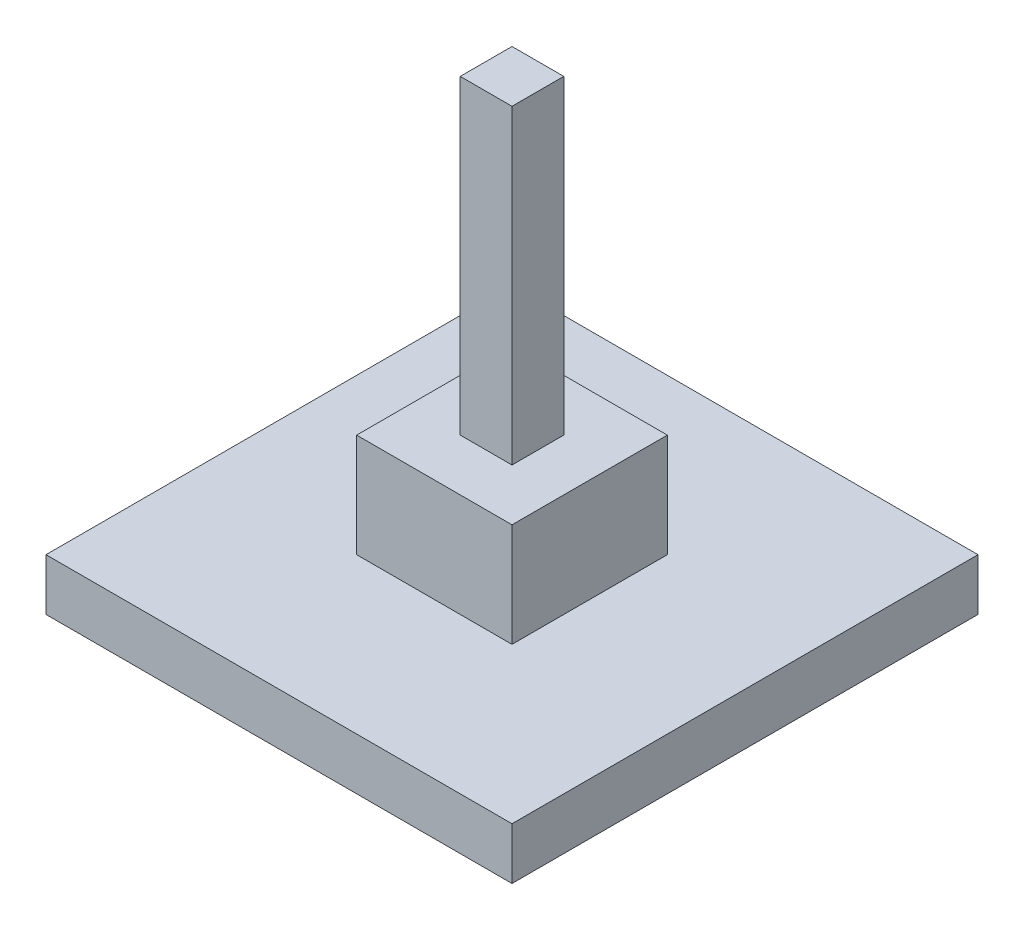
ISO-10303-21;
HEADER;
FILE_DESCRIPTION(('STEP AP214'),'2;1');
FILE_NAME('part.step','',(''),(''),'','','');
FILE_SCHEMA(('AUTOMOTIVE_DESIGN { 1 0 10303 214 1 1 1 1 }'));
ENDSEC;
DATA;
#1=APPLICATION_CONTEXT('core data for automotive mechanical design processes');
#2=APPLICATION_PROTOCOL_DEFINITION('international standard','automotive_design',2000,#1);
#3=PRODUCT_CONTEXT('',#1,'mechanical');
#4=PRODUCT('Part','Part','',(#3));
#5=PRODUCT_RELATED_PRODUCT_CATEGORY('part','',(#4));
#6=PRODUCT_DEFINITION_FORMATION('','',#4);
#7=PRODUCT_DEFINITION_CONTEXT('part definition',#1,'design');
#8=PRODUCT_DEFINITION('design','',#6,#7);
#9=PRODUCT_DEFINITION_SHAPE('','',#8);
#10=(LENGTH_UNIT() NAMED_UNIT(*) SI_UNIT(.MILLI.,.METRE.));
#11=(NAMED_UNIT(*) PLANE_ANGLE_UNIT() SI_UNIT($,.RADIAN.));
#12=(NAMED_UNIT(*) SI_UNIT($,.STERADIAN.) SOLID_ANGLE_UNIT());
#13=UNCERTAINTY_MEASURE_WITH_UNIT(LENGTH_MEASURE(1.E-05),#10,'distance_accuracy_value','');
#14=(GEOMETRIC_REPRESENTATION_CONTEXT(3) GLOBAL_UNCERTAINTY_ASSIGNED_CONTEXT((#13)) GLOBAL_UNIT_ASSIGNED_CONTEXT((#10,
#11,#12)) REPRESENTATION_CONTEXT('',''));
#15=CARTESIAN_POINT('',(0.,0.,0.));
#16=DIRECTION('',(0.,0.,1.));
#17=DIRECTION('',(1.,0.,0.));
#18=AXIS2_PLACEMENT_3D('',#15,#16,#17);
#19=CARTESIAN_POINT('',(0.,685.8,38.1));
#20=DIRECTION('',(0.,0.,-1.));
#21=DIRECTION('',(-1.,0.,0.));
#22=AXIS2_PLACEMENT_3D('',#19,#20,#21);
#23=PLANE('',#22);
#24=DIRECTION('',(0.,-1.,0.));
#25=VECTOR('',#24,1.);
#26=CARTESIAN_POINT('',(-38.1,685.8,38.1));
#27=LINE('',#26,#25);
#28=CARTESIAN_POINT('',(-38.1,685.8,38.1));
#29=VERTEX_POINT('',#28);
#30=CARTESIAN_POINT('',(-38.1,228.6,38.1));
#31=VERTEX_POINT('',#30);
#32=EDGE_CURVE('E214',#29,#31,#27,.T.);
#33=ORIENTED_EDGE('',*,*,#32,.T.);
#34=DIRECTION('',(1.,0.,0.));
#35=VECTOR('',#34,1.);
#36=CARTESIAN_POINT('',(0.,228.6,38.1));
#37=LINE('',#36,#35);
#38=CARTESIAN_POINT('',(38.1,228.6,38.1));
#39=VERTEX_POINT('',#38);
#40=EDGE_CURVE('E183',#31,#39,#37,.T.);
#41=ORIENTED_EDGE('',*,*,#40,.T.);
#42=DIRECTION('',(0.,-1.,0.));
#43=VECTOR('',#42,1.);
#44=CARTESIAN_POINT('',(38.1,685.8,38.1));
#45=LINE('',#44,#43);
#46=CARTESIAN_POINT('',(38.1,685.8,38.1));
#47=VERTEX_POINT('',#46);
#48=EDGE_CURVE('E11',#47,#39,#45,.T.);
#49=ORIENTED_EDGE('',*,*,#48,.F.);
#50=DIRECTION('',(1.,0.,0.));
#51=VECTOR('',#50,1.);
#52=CARTESIAN_POINT('',(0.,685.8,38.1));
#53=LINE('',#52,#51);
#54=EDGE_CURVE('E203',#29,#47,#53,.T.);
#55=ORIENTED_EDGE('',*,*,#54,.F.);
#56=EDGE_LOOP('',(#33,#41,#49,#55));
#57=FACE_BOUND('',#56,.T.);
#58=ADVANCED_FACE('F35',(#57),#23,.F.);
#59=CARTESIAN_POINT('',(38.1,685.8,0.));
#60=DIRECTION('',(-1.,0.,0.));
#61=DIRECTION('',(0.,0.,1.));
#62=AXIS2_PLACEMENT_3D('',#59,#60,#61);
#63=PLANE('',#62);
#64=ORIENTED_EDGE('',*,*,#48,.T.);
#65=DIRECTION('',(0.,0.,-1.));
#66=VECTOR('',#65,1.);
#67=CARTESIAN_POINT('',(38.1,228.6,0.));
#68=LINE('',#67,#66);
#69=CARTESIAN_POINT('',(38.1,228.6,-38.1));
#70=VERTEX_POINT('',#69);
#71=EDGE_CURVE('E181',#39,#70,#68,.T.);
#72=ORIENTED_EDGE('',*,*,#71,.T.);
#73=DIRECTION('',(0.,-1.,0.));
#74=VECTOR('',#73,1.);
#75=CARTESIAN_POINT('',(38.1,685.8,-38.1));
#76=LINE('',#75,#74);
#77=CARTESIAN_POINT('',(38.1,685.8,-38.1));
#78=VERTEX_POINT('',#77);
#79=EDGE_CURVE('E42',#78,#70,#76,.T.);
#80=ORIENTED_EDGE('',*,*,#79,.F.);
#81=DIRECTION('',(0.,0.,-1.));
#82=VECTOR('',#81,1.);
#83=CARTESIAN_POINT('',(38.1,685.8,0.));
#84=LINE('',#83,#82);
#85=EDGE_CURVE('E206',#47,#78,#84,.T.);
#86=ORIENTED_EDGE('',*,*,#85,.F.);
#87=EDGE_LOOP('',(#64,#72,#80,#86));
#88=FACE_BOUND('',#87,.T.);
#89=ADVANCED_FACE('F238',(#88),#63,.F.);
#90=CARTESIAN_POINT('',(0.,685.8,-38.1));
#91=DIRECTION('',(0.,0.,-1.));
#92=DIRECTION('',(-1.,0.,0.));
#93=AXIS2_PLACEMENT_3D('',#90,#91,#92);
#94=PLANE('',#93);
#95=DIRECTION('',(1.,0.,0.));
#96=VECTOR('',#95,1.);
#97=CARTESIAN_POINT('',(0.,228.6,-38.1));
#98=LINE('',#97,#96);
#99=CARTESIAN_POINT('',(-38.1,228.6,-38.1));
#100=VERTEX_POINT('',#99);
#101=EDGE_CURVE('E188',#100,#70,#98,.T.);
#102=ORIENTED_EDGE('',*,*,#101,.F.);
#103=DIRECTION('',(0.,-1.,0.));
#104=VECTOR('',#103,1.);
#105=CARTESIAN_POINT('',(-38.1,685.8,-38.1));
#106=LINE('',#105,#104);
#107=CARTESIAN_POINT('',(-38.1,685.8,-38.1));
#108=VERTEX_POINT('',#107);
#109=EDGE_CURVE('E217',#108,#100,#106,.T.);
#110=ORIENTED_EDGE('',*,*,#109,.F.);
#111=DIRECTION('',(1.,0.,0.));
#112=VECTOR('',#111,1.);
#113=CARTESIAN_POINT('',(0.,685.8,-38.1));
#114=LINE('',#113,#112);
#115=EDGE_CURVE('E208',#108,#78,#114,.T.);
#116=ORIENTED_EDGE('',*,*,#115,.T.);
#117=ORIENTED_EDGE('',*,*,#79,.T.);
#118=EDGE_LOOP('',(#102,#110,#116,#117));
#119=FACE_BOUND('',#118,.T.);
#120=ADVANCED_FACE('F222',(#119),#94,.T.);
#121=CARTESIAN_POINT('',(-38.1,685.8,0.));
#122=DIRECTION('',(-1.,0.,0.));
#123=DIRECTION('',(0.,0.,1.));
#124=AXIS2_PLACEMENT_3D('',#121,#122,#123);
#125=PLANE('',#124);
#126=DIRECTION('',(0.,0.,-1.));
#127=VECTOR('',#126,1.);
#128=CARTESIAN_POINT('',(-38.1,228.6,0.));
#129=LINE('',#128,#127);
#130=EDGE_CURVE('E185',#31,#100,#129,.T.);
#131=ORIENTED_EDGE('',*,*,#130,.F.);
#132=ORIENTED_EDGE('',*,*,#32,.F.);
#133=DIRECTION('',(0.,0.,-1.));
#134=VECTOR('',#133,1.);
#135=CARTESIAN_POINT('',(-38.1,685.8,0.));
#136=LINE('',#135,#134);
#137=EDGE_CURVE('E211',#29,#108,#136,.T.);
#138=ORIENTED_EDGE('',*,*,#137,.T.);
#139=ORIENTED_EDGE('',*,*,#109,.T.);
#140=EDGE_LOOP('',(#131,#132,#138,#139));
#141=FACE_BOUND('',#140,.T.);
#142=ADVANCED_FACE('F231',(#141),#125,.T.);
#143=CARTESIAN_POINT('',(0.,685.8,0.));
#144=DIRECTION('',(0.,1.,0.));
#145=DIRECTION('',(0.,0.,1.));
#146=AXIS2_PLACEMENT_3D('',#143,#144,#145);
#147=PLANE('',#146);
#148=ORIENTED_EDGE('',*,*,#54,.T.);
#149=ORIENTED_EDGE('',*,*,#85,.T.);
#150=ORIENTED_EDGE('',*,*,#115,.F.);
#151=ORIENTED_EDGE('',*,*,#137,.F.);
#152=EDGE_LOOP('',(#148,#149,#150,#151));
#153=FACE_BOUND('',#152,.T.);
#154=ADVANCED_FACE('F237',(#153),#147,.T.);
#155=CARTESIAN_POINT('',(0.,228.6,114.3));
#156=DIRECTION('',(0.,0.,-1.));
#157=DIRECTION('',(-1.,0.,0.));
#158=AXIS2_PLACEMENT_3D('',#155,#156,#157);
#159=PLANE('',#158);
#160=DIRECTION('',(0.,-1.,0.));
#161=VECTOR('',#160,1.);
#162=CARTESIAN_POINT('',(-114.3,228.6,114.3));
#163=LINE('',#162,#161);
#164=CARTESIAN_POINT('',(-114.3,228.6,114.3));
#165=VERTEX_POINT('',#164);
#166=CARTESIAN_POINT('',(-114.3,76.2,114.3));
#167=VERTEX_POINT('',#166);
#168=EDGE_CURVE('E136',#165,#167,#163,.T.);
#169=ORIENTED_EDGE('',*,*,#168,.T.);
#170=DIRECTION('',(1.,0.,0.));
#171=VECTOR('',#170,1.);
#172=CARTESIAN_POINT('',(0.,76.2,114.3));
#173=LINE('',#172,#171);
#174=CARTESIAN_POINT('',(114.3,76.2,114.3));
#175=VERTEX_POINT('',#174);
#176=EDGE_CURVE('E49',#167,#175,#173,.T.);
#177=ORIENTED_EDGE('',*,*,#176,.T.);
#178=DIRECTION('',(0.,-1.,0.));
#179=VECTOR('',#178,1.);
#180=CARTESIAN_POINT('',(114.3,228.6,114.3));
#181=LINE('',#180,#179);
#182=CARTESIAN_POINT('',(114.3,228.6,114.3));
#183=VERTEX_POINT('',#182);
#184=EDGE_CURVE('E201',#183,#175,#181,.T.);
#185=ORIENTED_EDGE('',*,*,#184,.F.);
#186=DIRECTION('',(1.,0.,0.));
#187=VECTOR('',#186,1.);
#188=CARTESIAN_POINT('',(0.,228.6,114.3));
#189=LINE('',#188,#187);
#190=EDGE_CURVE('E191',#165,#183,#189,.T.);
#191=ORIENTED_EDGE('',*,*,#190,.F.);
#192=EDGE_LOOP('',(#169,#177,#185,#191));
#193=FACE_BOUND('',#192,.T.);
#194=ADVANCED_FACE('F254',(#193),#159,.F.);
#195=CARTESIAN_POINT('',(114.3,228.6,0.));
#196=DIRECTION('',(-1.,0.,0.));
#197=DIRECTION('',(0.,0.,1.));
#198=AXIS2_PLACEMENT_3D('',#195,#196,#197);
#199=PLANE('',#198);
#200=ORIENTED_EDGE('',*,*,#184,.T.);
#201=DIRECTION('',(0.,0.,-1.));
#202=VECTOR('',#201,1.);
#203=CARTESIAN_POINT('',(114.3,76.2,0.));
#204=LINE('',#203,#202);
#205=CARTESIAN_POINT('',(114.3,76.2,-114.3));
#206=VERTEX_POINT('',#205);
#207=EDGE_CURVE('E56',#175,#206,#204,.T.);
#208=ORIENTED_EDGE('',*,*,#207,.T.);
#209=DIRECTION('',(0.,-1.,0.));
#210=VECTOR('',#209,1.);
#211=CARTESIAN_POINT('',(114.3,228.6,-114.3));
#212=LINE('',#211,#210);
#213=CARTESIAN_POINT('',(114.3,228.6,-114.3));
#214=VERTEX_POINT('',#213);
#215=EDGE_CURVE('E135',#214,#206,#212,.T.);
#216=ORIENTED_EDGE('',*,*,#215,.F.);
#217=DIRECTION('',(0.,0.,-1.));
#218=VECTOR('',#217,1.);
#219=CARTESIAN_POINT('',(114.3,228.6,0.));
#220=LINE('',#219,#218);
#221=EDGE_CURVE('E194',#183,#214,#220,.T.);
#222=ORIENTED_EDGE('',*,*,#221,.F.);
#223=EDGE_LOOP('',(#200,#208,#216,#222));
#224=FACE_BOUND('',#223,.T.);
#225=ADVANCED_FACE('F257',(#224),#199,.F.);
#226=CARTESIAN_POINT('',(0.,228.6,-114.3));
#227=DIRECTION('',(0.,0.,-1.));
#228=DIRECTION('',(-1.,0.,0.));
#229=AXIS2_PLACEMENT_3D('',#226,#227,#228);
#230=PLANE('',#229);
#231=DIRECTION('',(1.,0.,0.));
#232=VECTOR('',#231,1.);
#233=CARTESIAN_POINT('',(0.,76.2,-114.3));
#234=LINE('',#233,#232);
#235=CARTESIAN_POINT('',(-114.3,76.2,-114.3));
#236=VERTEX_POINT('',#235);
#237=EDGE_CURVE('E139',#236,#206,#234,.T.);
#238=ORIENTED_EDGE('',*,*,#237,.F.);
#239=DIRECTION('',(0.,-1.,0.));
#240=VECTOR('',#239,1.);
#241=CARTESIAN_POINT('',(-114.3,228.6,-114.3));
#242=LINE('',#241,#240);
#243=CARTESIAN_POINT('',(-114.3,228.6,-114.3));
#244=VERTEX_POINT('',#243);
#245=EDGE_CURVE('E125',#244,#236,#242,.T.);
#246=ORIENTED_EDGE('',*,*,#245,.F.);
#247=DIRECTION('',(1.,0.,0.));
#248=VECTOR('',#247,1.);
#249=CARTESIAN_POINT('',(0.,228.6,-114.3));
#250=LINE('',#249,#248);
#251=EDGE_CURVE('E196',#244,#214,#250,.T.);
#252=ORIENTED_EDGE('',*,*,#251,.T.);
#253=ORIENTED_EDGE('',*,*,#215,.T.);
#254=EDGE_LOOP('',(#238,#246,#252,#253));
#255=FACE_BOUND('',#254,.T.);
#256=ADVANCED_FACE('F140',(#255),#230,.T.);
#257=CARTESIAN_POINT('',(-114.3,228.6,0.));
#258=DIRECTION('',(-1.,0.,0.));
#259=DIRECTION('',(0.,0.,1.));
#260=AXIS2_PLACEMENT_3D('',#257,#258,#259);
#261=PLANE('',#260);
#262=DIRECTION('',(0.,0.,-1.));
#263=VECTOR('',#262,1.);
#264=CARTESIAN_POINT('',(-114.3,76.2,0.));
#265=LINE('',#264,#263);
#266=EDGE_CURVE('E129',#167,#236,#265,.T.);
#267=ORIENTED_EDGE('',*,*,#266,.F.);
#268=ORIENTED_EDGE('',*,*,#168,.F.);
#269=DIRECTION('',(0.,0.,-1.));
#270=VECTOR('',#269,1.);
#271=CARTESIAN_POINT('',(-114.3,228.6,0.));
#272=LINE('',#271,#270);
#273=EDGE_CURVE('E131',#165,#244,#272,.T.);
#274=ORIENTED_EDGE('',*,*,#273,.T.);
#275=ORIENTED_EDGE('',*,*,#245,.T.);
#276=EDGE_LOOP('',(#267,#268,#274,#275));
#277=FACE_BOUND('',#276,.T.);
#278=ADVANCED_FACE('F127',(#277),#261,.T.);
#279=CARTESIAN_POINT('',(0.,228.6,0.));
#280=DIRECTION('',(0.,1.,0.));
#281=DIRECTION('',(0.,0.,1.));
#282=AXIS2_PLACEMENT_3D('',#279,#280,#281);
#283=PLANE('',#282);
#284=ORIENTED_EDGE('',*,*,#71,.F.);
#285=ORIENTED_EDGE('',*,*,#40,.F.);
#286=ORIENTED_EDGE('',*,*,#130,.T.);
#287=ORIENTED_EDGE('',*,*,#101,.T.);
#288=EDGE_LOOP('',(#284,#285,#286,#287));
#289=FACE_BOUND('',#288,.T.);
#290=ORIENTED_EDGE('',*,*,#190,.T.);
#291=ORIENTED_EDGE('',*,*,#221,.T.);
#292=ORIENTED_EDGE('',*,*,#251,.F.);
#293=ORIENTED_EDGE('',*,*,#273,.F.);
#294=EDGE_LOOP('',(#290,#291,#292,#293));
#295=FACE_BOUND('',#294,.T.);
#296=ADVANCED_FACE('F227',(#289,#295),#283,.T.);
#297=CARTESIAN_POINT('',(0.,76.2,342.9));
#298=DIRECTION('',(0.,0.,-1.));
#299=DIRECTION('',(-1.,0.,0.));
#300=AXIS2_PLACEMENT_3D('',#297,#298,#299);
#301=PLANE('',#300);
#302=DIRECTION('',(1.,0.,0.));
#303=VECTOR('',#302,1.);
#304=CARTESIAN_POINT('',(0.,0.,342.9));
#305=LINE('',#304,#303);
#306=CARTESIAN_POINT('',(-342.9,0.,342.9));
#307=VERTEX_POINT('',#306);
#308=CARTESIAN_POINT('',(342.9,0.,342.9));
#309=VERTEX_POINT('',#308);
#310=EDGE_CURVE('E161',#307,#309,#305,.T.);
#311=ORIENTED_EDGE('',*,*,#310,.T.);
#312=DIRECTION('',(0.,-1.,0.));
#313=VECTOR('',#312,1.);
#314=CARTESIAN_POINT('',(342.9,76.2,342.9));
#315=LINE('',#314,#313);
#316=CARTESIAN_POINT('',(342.9,76.2,342.9));
#317=VERTEX_POINT('',#316);
#318=EDGE_CURVE('E178',#317,#309,#315,.T.);
#319=ORIENTED_EDGE('',*,*,#318,.F.);
#320=DIRECTION('',(1.,0.,0.));
#321=VECTOR('',#320,1.);
#322=CARTESIAN_POINT('',(0.,76.2,342.9));
#323=LINE('',#322,#321);
#324=CARTESIAN_POINT('',(-342.9,76.2,342.9));
#325=VERTEX_POINT('',#324);
#326=EDGE_CURVE('E142',#325,#317,#323,.T.);
#327=ORIENTED_EDGE('',*,*,#326,.F.);
#328=DIRECTION('',(0.,-1.,0.));
#329=VECTOR('',#328,1.);
#330=CARTESIAN_POINT('',(-342.9,76.2,342.9));
#331=LINE('',#330,#329);
#332=EDGE_CURVE('E160',#325,#307,#331,.T.);
#333=ORIENTED_EDGE('',*,*,#332,.T.);
#334=EDGE_LOOP('',(#311,#319,#327,#333));
#335=FACE_BOUND('',#334,.T.);
#336=ADVANCED_FACE('F266',(#335),#301,.F.);
#337=CARTESIAN_POINT('',(342.9,76.2,0.));
#338=DIRECTION('',(-1.,0.,0.));
#339=DIRECTION('',(0.,0.,1.));
#340=AXIS2_PLACEMENT_3D('',#337,#338,#339);
#341=PLANE('',#340);
#342=DIRECTION('',(0.,0.,-1.));
#343=VECTOR('',#342,1.);
#344=CARTESIAN_POINT('',(342.9,0.,0.));
#345=LINE('',#344,#343);
#346=CARTESIAN_POINT('',(342.9,0.,-342.9));
#347=VERTEX_POINT('',#346);
#348=EDGE_CURVE('E164',#309,#347,#345,.T.);
#349=ORIENTED_EDGE('',*,*,#348,.T.);
#350=DIRECTION('',(0.,-1.,0.));
#351=VECTOR('',#350,1.);
#352=CARTESIAN_POINT('',(342.9,76.2,-342.9));
#353=LINE('',#352,#351);
#354=CARTESIAN_POINT('',(342.9,76.2,-342.9));
#355=VERTEX_POINT('',#354);
#356=EDGE_CURVE('E176',#355,#347,#353,.T.);
#357=ORIENTED_EDGE('',*,*,#356,.F.);
#358=DIRECTION('',(0.,0.,-1.));
#359=VECTOR('',#358,1.);
#360=CARTESIAN_POINT('',(342.9,76.2,0.));
#361=LINE('',#360,#359);
#362=EDGE_CURVE('E152',#317,#355,#361,.T.);
#363=ORIENTED_EDGE('',*,*,#362,.F.);
#364=ORIENTED_EDGE('',*,*,#318,.T.);
#365=EDGE_LOOP('',(#349,#357,#363,#364));
#366=FACE_BOUND('',#365,.T.);
#367=ADVANCED_FACE('F269',(#366),#341,.F.);
#368=CARTESIAN_POINT('',(0.,76.2,-342.9));
#369=DIRECTION('',(0.,0.,-1.));
#370=DIRECTION('',(-1.,0.,0.));
#371=AXIS2_PLACEMENT_3D('',#368,#369,#370);
#372=PLANE('',#371);
#373=DIRECTION('',(1.,0.,0.));
#374=VECTOR('',#373,1.);
#375=CARTESIAN_POINT('',(0.,0.,-342.9));
#376=LINE('',#375,#374);
#377=CARTESIAN_POINT('',(-342.9,0.,-342.9));
#378=VERTEX_POINT('',#377);
#379=EDGE_CURVE('E167',#378,#347,#376,.T.);
#380=ORIENTED_EDGE('',*,*,#379,.F.);
#381=DIRECTION('',(0.,-1.,0.));
#382=VECTOR('',#381,1.);
#383=CARTESIAN_POINT('',(-342.9,76.2,-342.9));
#384=LINE('',#383,#382);
#385=CARTESIAN_POINT('',(-342.9,76.2,-342.9));
#386=VERTEX_POINT('',#385);
#387=EDGE_CURVE('E174',#386,#378,#384,.T.);
#388=ORIENTED_EDGE('',*,*,#387,.F.);
#389=DIRECTION('',(1.,0.,0.));
#390=VECTOR('',#389,1.);
#391=CARTESIAN_POINT('',(0.,76.2,-342.9));
#392=LINE('',#391,#390);
#393=EDGE_CURVE('E154',#386,#355,#392,.T.);
#394=ORIENTED_EDGE('',*,*,#393,.T.);
#395=ORIENTED_EDGE('',*,*,#356,.T.);
#396=EDGE_LOOP('',(#380,#388,#394,#395));
#397=FACE_BOUND('',#396,.T.);
#398=ADVANCED_FACE('F273',(#397),#372,.T.);
#399=CARTESIAN_POINT('',(-342.9,76.2,0.));
#400=DIRECTION('',(-1.,0.,0.));
#401=DIRECTION('',(0.,0.,1.));
#402=AXIS2_PLACEMENT_3D('',#399,#400,#401);
#403=PLANE('',#402);
#404=DIRECTION('',(0.,0.,-1.));
#405=VECTOR('',#404,1.);
#406=CARTESIAN_POINT('',(-342.9,0.,0.));
#407=LINE('',#406,#405);
#408=EDGE_CURVE('E170',#307,#378,#407,.T.);
#409=ORIENTED_EDGE('',*,*,#408,.F.);
#410=ORIENTED_EDGE('',*,*,#332,.F.);
#411=DIRECTION('',(0.,0.,-1.));
#412=VECTOR('',#411,1.);
#413=CARTESIAN_POINT('',(-342.9,76.2,0.));
#414=LINE('',#413,#412);
#415=EDGE_CURVE('E157',#325,#386,#414,.T.);
#416=ORIENTED_EDGE('',*,*,#415,.T.);
#417=ORIENTED_EDGE('',*,*,#387,.T.);
#418=EDGE_LOOP('',(#409,#410,#416,#417));
#419=FACE_BOUND('',#418,.T.);
#420=ADVANCED_FACE('F277',(#419),#403,.T.);
#421=CARTESIAN_POINT('',(0.,76.2,0.));
#422=DIRECTION('',(0.,1.,0.));
#423=DIRECTION('',(0.,0.,1.));
#424=AXIS2_PLACEMENT_3D('',#421,#422,#423);
#425=PLANE('',#424);
#426=ORIENTED_EDGE('',*,*,#207,.F.);
#427=ORIENTED_EDGE('',*,*,#176,.F.);
#428=ORIENTED_EDGE('',*,*,#266,.T.);
#429=ORIENTED_EDGE('',*,*,#237,.T.);
#430=EDGE_LOOP('',(#426,#427,#428,#429));
#431=FACE_BOUND('',#430,.T.);
#432=ORIENTED_EDGE('',*,*,#326,.T.);
#433=ORIENTED_EDGE('',*,*,#362,.T.);
#434=ORIENTED_EDGE('',*,*,#393,.F.);
#435=ORIENTED_EDGE('',*,*,#415,.F.);
#436=EDGE_LOOP('',(#432,#433,#434,#435));
#437=FACE_BOUND('',#436,.T.);
#438=ADVANCED_FACE('F144',(#431,#437),#425,.T.);
#439=CARTESIAN_POINT('',(0.,0.,0.));
#440=DIRECTION('',(0.,1.,0.));
#441=DIRECTION('',(0.,0.,1.));
#442=AXIS2_PLACEMENT_3D('',#439,#440,#441);
#443=PLANE('',#442);
#444=ORIENTED_EDGE('',*,*,#310,.F.);
#445=ORIENTED_EDGE('',*,*,#408,.T.);
#446=ORIENTED_EDGE('',*,*,#379,.T.);
#447=ORIENTED_EDGE('',*,*,#348,.F.);
#448=EDGE_LOOP('',(#444,#445,#446,#447));
#449=FACE_BOUND('',#448,.T.);
#450=ADVANCED_FACE('F248',(#449),#443,.F.);
#451=CLOSED_SHELL('',(#58,#89,#120,#142,#154,#194,#225,#256,#278,#296,#336,#367,#398,#420,#438,#450));
#452=MANIFOLD_SOLID_BREP('B2',#451);
#453=ADVANCED_BREP_SHAPE_REPRESENTATION('',(#18,#452),#14);
#454=SHAPE_DEFINITION_REPRESENTATION(#9,#453);
ENDSEC;
END-ISO-10303-21;
